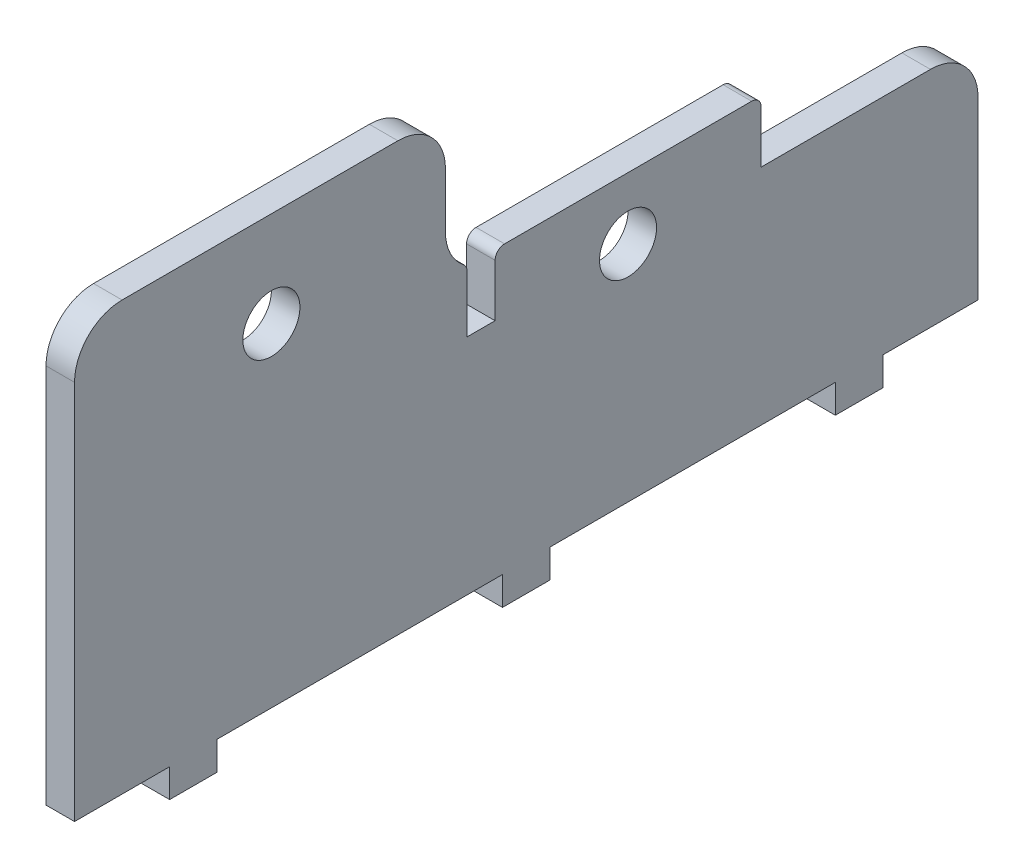
ISO-10303-21;
HEADER;
FILE_DESCRIPTION(('STEP AP214'),'2;1');
FILE_NAME('part.step','',(''),(''),'','','');
FILE_SCHEMA(('AUTOMOTIVE_DESIGN { 1 0 10303 214 1 1 1 1 }'));
ENDSEC;
DATA;
#1=APPLICATION_CONTEXT('core data for automotive mechanical design processes');
#2=APPLICATION_PROTOCOL_DEFINITION('international standard','automotive_design',2000,#1);
#3=PRODUCT_CONTEXT('',#1,'mechanical');
#4=PRODUCT('Part','Part','',(#3));
#5=PRODUCT_RELATED_PRODUCT_CATEGORY('part','',(#4));
#6=PRODUCT_DEFINITION_FORMATION('','',#4);
#7=PRODUCT_DEFINITION_CONTEXT('part definition',#1,'design');
#8=PRODUCT_DEFINITION('design','',#6,#7);
#9=PRODUCT_DEFINITION_SHAPE('','',#8);
#10=(LENGTH_UNIT() NAMED_UNIT(*) SI_UNIT(.MILLI.,.METRE.));
#11=(NAMED_UNIT(*) PLANE_ANGLE_UNIT() SI_UNIT($,.RADIAN.));
#12=(NAMED_UNIT(*) SI_UNIT($,.STERADIAN.) SOLID_ANGLE_UNIT());
#13=UNCERTAINTY_MEASURE_WITH_UNIT(LENGTH_MEASURE(1.E-05),#10,'distance_accuracy_value','');
#14=(GEOMETRIC_REPRESENTATION_CONTEXT(3) GLOBAL_UNCERTAINTY_ASSIGNED_CONTEXT((#13)) GLOBAL_UNIT_ASSIGNED_CONTEXT((#10,
#11,#12)) REPRESENTATION_CONTEXT('',''));
#15=CARTESIAN_POINT('',(0.,0.,0.));
#16=DIRECTION('',(0.,0.,1.));
#17=DIRECTION('',(1.,0.,0.));
#18=AXIS2_PLACEMENT_3D('',#15,#16,#17);
#19=CARTESIAN_POINT('',(3.,0.,-65.));
#20=DIRECTION('',(0.,1.,0.));
#21=DIRECTION('',(0.,0.,1.));
#22=AXIS2_PLACEMENT_3D('',#19,#20,#21);
#23=PLANE('',#22);
#24=DIRECTION('',(0.,0.,-1.));
#25=VECTOR('',#24,1.);
#26=CARTESIAN_POINT('',(0.,0.,-65.));
#27=LINE('',#26,#25);
#28=CARTESIAN_POINT('',(0.,0.,-20.));
#29=VERTEX_POINT('',#28);
#30=CARTESIAN_POINT('',(0.,0.,-50.));
#31=VERTEX_POINT('',#30);
#32=EDGE_CURVE('E541',#29,#31,#27,.T.);
#33=ORIENTED_EDGE('',*,*,#32,.T.);
#34=DIRECTION('',(1.,0.,0.));
#35=VECTOR('',#34,1.);
#36=CARTESIAN_POINT('',(3.,0.,-50.));
#37=LINE('',#36,#35);
#38=CARTESIAN_POINT('',(3.,0.,-50.));
#39=VERTEX_POINT('',#38);
#40=EDGE_CURVE('E282',#31,#39,#37,.T.);
#41=ORIENTED_EDGE('',*,*,#40,.T.);
#42=DIRECTION('',(0.,0.,-1.));
#43=VECTOR('',#42,1.);
#44=CARTESIAN_POINT('',(3.,0.,-65.));
#45=LINE('',#44,#43);
#46=CARTESIAN_POINT('',(3.,0.,-20.));
#47=VERTEX_POINT('',#46);
#48=EDGE_CURVE('E527',#47,#39,#45,.T.);
#49=ORIENTED_EDGE('',*,*,#48,.F.);
#50=DIRECTION('',(-1.,0.,0.));
#51=VECTOR('',#50,1.);
#52=CARTESIAN_POINT('',(3.,0.,-20.));
#53=LINE('',#52,#51);
#54=EDGE_CURVE('E298',#47,#29,#53,.T.);
#55=ORIENTED_EDGE('',*,*,#54,.T.);
#56=EDGE_LOOP('',(#33,#41,#49,#55));
#57=FACE_BOUND('',#56,.T.);
#58=ADVANCED_FACE('F36',(#57),#23,.F.);
#59=CARTESIAN_POINT('',(0.,0.,15.));
#60=VERTEX_POINT('',#59);
#61=CARTESIAN_POINT('',(0.,0.,-15.));
#62=VERTEX_POINT('',#61);
#63=EDGE_CURVE('E407',#60,#62,#27,.T.);
#64=ORIENTED_EDGE('',*,*,#63,.T.);
#65=DIRECTION('',(1.,0.,0.));
#66=VECTOR('',#65,1.);
#67=CARTESIAN_POINT('',(3.,0.,-15.));
#68=LINE('',#67,#66);
#69=CARTESIAN_POINT('',(3.,0.,-15.));
#70=VERTEX_POINT('',#69);
#71=EDGE_CURVE('E311',#62,#70,#68,.T.);
#72=ORIENTED_EDGE('',*,*,#71,.T.);
#73=CARTESIAN_POINT('',(3.,0.,15.));
#74=VERTEX_POINT('',#73);
#75=EDGE_CURVE('E394',#74,#70,#45,.T.);
#76=ORIENTED_EDGE('',*,*,#75,.F.);
#77=DIRECTION('',(-1.,0.,0.));
#78=VECTOR('',#77,1.);
#79=CARTESIAN_POINT('',(3.,0.,15.));
#80=LINE('',#79,#78);
#81=EDGE_CURVE('E359',#74,#60,#80,.T.);
#82=ORIENTED_EDGE('',*,*,#81,.T.);
#83=EDGE_LOOP('',(#64,#72,#76,#82));
#84=FACE_BOUND('',#83,.T.);
#85=ADVANCED_FACE('F585',(#84),#23,.F.);
#86=CARTESIAN_POINT('',(3.,30.,-65.));
#87=DIRECTION('',(0.,-1.,0.));
#88=DIRECTION('',(0.,0.,-1.));
#89=AXIS2_PLACEMENT_3D('',#86,#87,#88);
#90=PLANE('',#89);
#91=DIRECTION('',(0.,0.,1.));
#92=VECTOR('',#91,1.);
#93=CARTESIAN_POINT('',(3.,30.,-65.));
#94=LINE('',#93,#92);
#95=CARTESIAN_POINT('',(3.,30.,-41.2));
#96=VERTEX_POINT('',#95);
#97=CARTESIAN_POINT('',(3.,30.,-15.2213645180627));
#98=VERTEX_POINT('',#97);
#99=EDGE_CURVE('E397',#96,#98,#94,.T.);
#100=ORIENTED_EDGE('',*,*,#99,.F.);
#101=DIRECTION('',(1.,0.,0.));
#102=VECTOR('',#101,1.);
#103=CARTESIAN_POINT('',(3.,30.,-41.2));
#104=LINE('',#103,#102);
#105=CARTESIAN_POINT('',(0.,30.,-41.2));
#106=VERTEX_POINT('',#105);
#107=EDGE_CURVE('E461',#96,#106,#104,.F.);
#108=ORIENTED_EDGE('',*,*,#107,.T.);
#109=DIRECTION('',(0.,0.,1.));
#110=VECTOR('',#109,1.);
#111=CARTESIAN_POINT('',(0.,30.,-65.));
#112=LINE('',#111,#110);
#113=CARTESIAN_POINT('',(0.,30.,-15.2213645180627));
#114=VERTEX_POINT('',#113);
#115=EDGE_CURVE('E389',#106,#114,#112,.T.);
#116=ORIENTED_EDGE('',*,*,#115,.T.);
#117=DIRECTION('',(1.,0.,0.));
#118=VECTOR('',#117,1.);
#119=CARTESIAN_POINT('',(3.,30.,-15.2213645180627));
#120=LINE('',#119,#118);
#121=EDGE_CURVE('E458',#114,#98,#120,.T.);
#122=ORIENTED_EDGE('',*,*,#121,.T.);
#123=EDGE_LOOP('',(#100,#108,#116,#122));
#124=FACE_BOUND('',#123,.T.);
#125=ADVANCED_FACE('F569',(#124),#90,.F.);
#126=CARTESIAN_POINT('',(3.,0.,-55.));
#127=VERTEX_POINT('',#126);
#128=CARTESIAN_POINT('',(3.,0.,-65.));
#129=VERTEX_POINT('',#128);
#130=EDGE_CURVE('E388',#127,#129,#45,.T.);
#131=ORIENTED_EDGE('',*,*,#130,.F.);
#132=DIRECTION('',(-1.,0.,0.));
#133=VECTOR('',#132,1.);
#134=CARTESIAN_POINT('',(3.,0.,-55.));
#135=LINE('',#134,#133);
#136=CARTESIAN_POINT('',(0.,0.,-55.));
#137=VERTEX_POINT('',#136);
#138=EDGE_CURVE('E264',#127,#137,#135,.T.);
#139=ORIENTED_EDGE('',*,*,#138,.T.);
#140=CARTESIAN_POINT('',(0.,0.,-65.));
#141=VERTEX_POINT('',#140);
#142=EDGE_CURVE('E402',#137,#141,#27,.T.);
#143=ORIENTED_EDGE('',*,*,#142,.T.);
#144=DIRECTION('',(-1.,0.,0.));
#145=VECTOR('',#144,1.);
#146=CARTESIAN_POINT('',(3.,0.,-65.));
#147=LINE('',#146,#145);
#148=EDGE_CURVE('E400',#129,#141,#147,.T.);
#149=ORIENTED_EDGE('',*,*,#148,.F.);
#150=EDGE_LOOP('',(#131,#139,#143,#149));
#151=FACE_BOUND('',#150,.T.);
#152=ADVANCED_FACE('F547',(#151),#23,.F.);
#153=CARTESIAN_POINT('',(3.,0.,30.));
#154=DIRECTION('',(0.,0.,-1.));
#155=DIRECTION('',(-1.,0.,0.));
#156=AXIS2_PLACEMENT_3D('',#153,#154,#155);
#157=PLANE('',#156);
#158=DIRECTION('',(0.,-1.,0.));
#159=VECTOR('',#158,1.);
#160=CARTESIAN_POINT('',(3.,0.,30.));
#161=LINE('',#160,#159);
#162=CARTESIAN_POINT('',(3.,40.,30.));
#163=VERTEX_POINT('',#162);
#164=CARTESIAN_POINT('',(3.,0.,30.));
#165=VERTEX_POINT('',#164);
#166=EDGE_CURVE('E386',#163,#165,#161,.T.);
#167=ORIENTED_EDGE('',*,*,#166,.F.);
#168=DIRECTION('',(1.,0.,0.));
#169=VECTOR('',#168,1.);
#170=CARTESIAN_POINT('',(0.,40.,30.));
#171=LINE('',#170,#169);
#172=CARTESIAN_POINT('',(0.,40.,30.));
#173=VERTEX_POINT('',#172);
#174=EDGE_CURVE('E443',#163,#173,#171,.F.);
#175=ORIENTED_EDGE('',*,*,#174,.T.);
#176=DIRECTION('',(0.,-1.,0.));
#177=VECTOR('',#176,1.);
#178=CARTESIAN_POINT('',(0.,0.,30.));
#179=LINE('',#178,#177);
#180=CARTESIAN_POINT('',(0.,0.,30.));
#181=VERTEX_POINT('',#180);
#182=EDGE_CURVE('E380',#173,#181,#179,.T.);
#183=ORIENTED_EDGE('',*,*,#182,.T.);
#184=DIRECTION('',(-1.,0.,0.));
#185=VECTOR('',#184,1.);
#186=CARTESIAN_POINT('',(3.,0.,30.));
#187=LINE('',#186,#185);
#188=EDGE_CURVE('E240',#165,#181,#187,.T.);
#189=ORIENTED_EDGE('',*,*,#188,.F.);
#190=EDGE_LOOP('',(#167,#175,#183,#189));
#191=FACE_BOUND('',#190,.T.);
#192=ADVANCED_FACE('F505',(#191),#157,.F.);
#193=CARTESIAN_POINT('',(0.,0.,20.));
#194=VERTEX_POINT('',#193);
#195=EDGE_CURVE('E403',#181,#194,#27,.T.);
#196=ORIENTED_EDGE('',*,*,#195,.T.);
#197=DIRECTION('',(1.,0.,0.));
#198=VECTOR('',#197,1.);
#199=CARTESIAN_POINT('',(3.,0.,20.));
#200=LINE('',#199,#198);
#201=CARTESIAN_POINT('',(3.,0.,20.));
#202=VERTEX_POINT('',#201);
#203=EDGE_CURVE('E364',#194,#202,#200,.T.);
#204=ORIENTED_EDGE('',*,*,#203,.T.);
#205=EDGE_CURVE('E390',#165,#202,#45,.T.);
#206=ORIENTED_EDGE('',*,*,#205,.F.);
#207=ORIENTED_EDGE('',*,*,#188,.T.);
#208=EDGE_LOOP('',(#196,#204,#206,#207));
#209=FACE_BOUND('',#208,.T.);
#210=ADVANCED_FACE('F509',(#209),#23,.F.);
#211=CARTESIAN_POINT('',(3.,0.,-65.));
#212=DIRECTION('',(0.,0.,1.));
#213=DIRECTION('',(1.,0.,0.));
#214=AXIS2_PLACEMENT_3D('',#211,#212,#213);
#215=PLANE('',#214);
#216=DIRECTION('',(0.,1.,0.));
#217=VECTOR('',#216,1.);
#218=CARTESIAN_POINT('',(0.,0.,-65.));
#219=LINE('',#218,#217);
#220=CARTESIAN_POINT('',(0.,18.5,-65.));
#221=VERTEX_POINT('',#220);
#222=EDGE_CURVE('E406',#141,#221,#219,.T.);
#223=ORIENTED_EDGE('',*,*,#222,.T.);
#224=DIRECTION('',(1.,0.,0.));
#225=VECTOR('',#224,1.);
#226=CARTESIAN_POINT('',(3.,18.5,-65.));
#227=LINE('',#226,#225);
#228=CARTESIAN_POINT('',(3.,18.5,-65.));
#229=VERTEX_POINT('',#228);
#230=EDGE_CURVE('E420',#221,#229,#227,.T.);
#231=ORIENTED_EDGE('',*,*,#230,.T.);
#232=DIRECTION('',(0.,1.,0.));
#233=VECTOR('',#232,1.);
#234=CARTESIAN_POINT('',(3.,0.,-65.));
#235=LINE('',#234,#233);
#236=EDGE_CURVE('E393',#129,#229,#235,.T.);
#237=ORIENTED_EDGE('',*,*,#236,.F.);
#238=ORIENTED_EDGE('',*,*,#148,.T.);
#239=EDGE_LOOP('',(#223,#231,#237,#238));
#240=FACE_BOUND('',#239,.T.);
#241=ADVANCED_FACE('F550',(#240),#215,.F.);
#242=CARTESIAN_POINT('',(3.,0.,0.));
#243=DIRECTION('',(1.,0.,0.));
#244=DIRECTION('',(0.,0.,-1.));
#245=AXIS2_PLACEMENT_3D('',#242,#243,#244);
#246=PLANE('',#245);
#247=DIRECTION('',(0.,-1.,0.));
#248=VECTOR('',#247,1.);
#249=CARTESIAN_POINT('',(3.,30.,-42.2));
#250=LINE('',#249,#248);
#251=CARTESIAN_POINT('',(3.,29.,-42.2));
#252=VERTEX_POINT('',#251);
#253=CARTESIAN_POINT('',(3.,23.5,-42.2));
#254=VERTEX_POINT('',#253);
#255=EDGE_CURVE('E272',#252,#254,#250,.T.);
#256=ORIENTED_EDGE('',*,*,#255,.F.);
#257=CARTESIAN_POINT('',(3.,29.,-41.2));
#258=DIRECTION('',(1.,0.,0.));
#259=DIRECTION('',(0.,0.,-1.));
#260=AXIS2_PLACEMENT_3D('',#257,#258,#259);
#261=CIRCLE('',#260,1.);
#262=EDGE_CURVE('E456',#252,#96,#261,.T.);
#263=ORIENTED_EDGE('',*,*,#262,.T.);
#264=ORIENTED_EDGE('',*,*,#99,.T.);
#265=CARTESIAN_POINT('',(3.,29.,-15.2213645180627));
#266=DIRECTION('',(1.,0.,0.));
#267=DIRECTION('',(0.,0.,-1.));
#268=AXIS2_PLACEMENT_3D('',#265,#266,#267);
#269=CIRCLE('',#268,1.);
#270=CARTESIAN_POINT('',(3.,29.,-14.2213645180627));
#271=VERTEX_POINT('',#270);
#272=EDGE_CURVE('E452',#98,#271,#269,.T.);
#273=ORIENTED_EDGE('',*,*,#272,.T.);
#274=DIRECTION('',(0.,1.,0.));
#275=VECTOR('',#274,1.);
#276=CARTESIAN_POINT('',(3.,32.2061925482817,-14.2213645180627));
#277=LINE('',#276,#275);
#278=CARTESIAN_POINT('',(3.,23.5,-14.2213645180627));
#279=VERTEX_POINT('',#278);
#280=EDGE_CURVE('E255',#279,#271,#277,.T.);
#281=ORIENTED_EDGE('',*,*,#280,.F.);
#282=DIRECTION('',(0.,0.,-1.));
#283=VECTOR('',#282,1.);
#284=CARTESIAN_POINT('',(3.,23.5,-11.2713645180627));
#285=LINE('',#284,#283);
#286=CARTESIAN_POINT('',(3.,23.5,-11.2713645180627));
#287=VERTEX_POINT('',#286);
#288=EDGE_CURVE('E258',#287,#279,#285,.T.);
#289=ORIENTED_EDGE('',*,*,#288,.F.);
#290=DIRECTION('',(0.,-1.,0.));
#291=VECTOR('',#290,1.);
#292=CARTESIAN_POINT('',(3.,32.2061925482817,-11.2713645180627));
#293=LINE('',#292,#291);
#294=CARTESIAN_POINT('',(3.,29.4890407092853,-11.2713645180627));
#295=VERTEX_POINT('',#294);
#296=EDGE_CURVE('E246',#295,#287,#293,.T.);
#297=ORIENTED_EDGE('',*,*,#296,.F.);
#298=CARTESIAN_POINT('',(3.,29.4890407092853,-10.2713645180627));
#299=DIRECTION('',(1.,0.,0.));
#300=DIRECTION('',(0.,0.,-1.));
#301=AXIS2_PLACEMENT_3D('',#298,#299,#300);
#302=CIRCLE('',#301,1.);
#303=CARTESIAN_POINT('',(3.,30.2725030646675,-10.8928037650522));
#304=VERTEX_POINT('',#303);
#305=EDGE_CURVE('E454',#295,#304,#302,.T.);
#306=ORIENTED_EDGE('',*,*,#305,.T.);
#307=CARTESIAN_POINT('',(3.,34.1898148415786,-14.));
#308=DIRECTION('',(1.,0.,0.));
#309=DIRECTION('',(0.,0.,-1.));
#310=AXIS2_PLACEMENT_3D('',#307,#308,#309);
#311=CIRCLE('',#310,5.);
#312=CARTESIAN_POINT('',(3.,34.1898148415786,-9.));
#313=VERTEX_POINT('',#312);
#314=EDGE_CURVE('E447',#304,#313,#311,.F.);
#315=ORIENTED_EDGE('',*,*,#314,.T.);
#316=DIRECTION('',(0.,-1.,0.));
#317=VECTOR('',#316,1.);
#318=CARTESIAN_POINT('',(3.,45.,-9.));
#319=LINE('',#318,#317);
#320=CARTESIAN_POINT('',(3.,40.,-9.));
#321=VERTEX_POINT('',#320);
#322=EDGE_CURVE('E356',#321,#313,#319,.T.);
#323=ORIENTED_EDGE('',*,*,#322,.F.);
#324=CARTESIAN_POINT('',(3.,40.,-4.));
#325=DIRECTION('',(1.,0.,0.));
#326=DIRECTION('',(0.,0.,-1.));
#327=AXIS2_PLACEMENT_3D('',#324,#325,#326);
#328=CIRCLE('',#327,5.);
#329=CARTESIAN_POINT('',(3.,45.,-4.));
#330=VERTEX_POINT('',#329);
#331=EDGE_CURVE('E425',#321,#330,#328,.T.);
#332=ORIENTED_EDGE('',*,*,#331,.T.);
#333=DIRECTION('',(0.,0.,-1.));
#334=VECTOR('',#333,1.);
#335=CARTESIAN_POINT('',(3.,45.,-9.));
#336=LINE('',#335,#334);
#337=CARTESIAN_POINT('',(3.,45.,25.));
#338=VERTEX_POINT('',#337);
#339=EDGE_CURVE('E350',#338,#330,#336,.T.);
#340=ORIENTED_EDGE('',*,*,#339,.F.);
#341=CARTESIAN_POINT('',(3.,40.,25.));
#342=DIRECTION('',(1.,0.,0.));
#343=DIRECTION('',(0.,0.,-1.));
#344=AXIS2_PLACEMENT_3D('',#341,#342,#343);
#345=CIRCLE('',#344,5.);
#346=EDGE_CURVE('E423',#338,#163,#345,.T.);
#347=ORIENTED_EDGE('',*,*,#346,.T.);
#348=ORIENTED_EDGE('',*,*,#166,.T.);
#349=ORIENTED_EDGE('',*,*,#205,.T.);
#350=DIRECTION('',(0.,1.,0.));
#351=VECTOR('',#350,1.);
#352=CARTESIAN_POINT('',(3.,-3.,20.));
#353=LINE('',#352,#351);
#354=CARTESIAN_POINT('',(3.,-3.,20.));
#355=VERTEX_POINT('',#354);
#356=EDGE_CURVE('E378',#355,#202,#353,.T.);
#357=ORIENTED_EDGE('',*,*,#356,.F.);
#358=DIRECTION('',(0.,0.,-1.));
#359=VECTOR('',#358,1.);
#360=CARTESIAN_POINT('',(3.,-3.,20.));
#361=LINE('',#360,#359);
#362=CARTESIAN_POINT('',(3.,-3.,15.));
#363=VERTEX_POINT('',#362);
#364=EDGE_CURVE('E360',#355,#363,#361,.T.);
#365=ORIENTED_EDGE('',*,*,#364,.T.);
#366=DIRECTION('',(0.,1.,0.));
#367=VECTOR('',#366,1.);
#368=CARTESIAN_POINT('',(3.,-3.,15.));
#369=LINE('',#368,#367);
#370=EDGE_CURVE('E373',#363,#74,#369,.T.);
#371=ORIENTED_EDGE('',*,*,#370,.T.);
#372=ORIENTED_EDGE('',*,*,#75,.T.);
#373=DIRECTION('',(0.,1.,0.));
#374=VECTOR('',#373,1.);
#375=CARTESIAN_POINT('',(3.,-3.,-15.));
#376=LINE('',#375,#374);
#377=CARTESIAN_POINT('',(3.,-3.,-15.));
#378=VERTEX_POINT('',#377);
#379=EDGE_CURVE('E324',#378,#70,#376,.T.);
#380=ORIENTED_EDGE('',*,*,#379,.F.);
#381=DIRECTION('',(0.,0.,-1.));
#382=VECTOR('',#381,1.);
#383=CARTESIAN_POINT('',(3.,-3.,-15.));
#384=LINE('',#383,#382);
#385=CARTESIAN_POINT('',(3.,-3.,-20.));
#386=VERTEX_POINT('',#385);
#387=EDGE_CURVE('E307',#378,#386,#384,.T.);
#388=ORIENTED_EDGE('',*,*,#387,.T.);
#389=DIRECTION('',(0.,1.,0.));
#390=VECTOR('',#389,1.);
#391=CARTESIAN_POINT('',(3.,-3.,-20.));
#392=LINE('',#391,#390);
#393=EDGE_CURVE('E320',#386,#47,#392,.T.);
#394=ORIENTED_EDGE('',*,*,#393,.T.);
#395=ORIENTED_EDGE('',*,*,#48,.T.);
#396=DIRECTION('',(0.,1.,0.));
#397=VECTOR('',#396,1.);
#398=CARTESIAN_POINT('',(3.,-3.,-50.));
#399=LINE('',#398,#397);
#400=CARTESIAN_POINT('',(3.,-3.,-50.));
#401=VERTEX_POINT('',#400);
#402=EDGE_CURVE('E295',#401,#39,#399,.T.);
#403=ORIENTED_EDGE('',*,*,#402,.F.);
#404=DIRECTION('',(0.,0.,-1.));
#405=VECTOR('',#404,1.);
#406=CARTESIAN_POINT('',(3.,-3.,-50.));
#407=LINE('',#406,#405);
#408=CARTESIAN_POINT('',(3.,-3.,-55.));
#409=VERTEX_POINT('',#408);
#410=EDGE_CURVE('E278',#401,#409,#407,.T.);
#411=ORIENTED_EDGE('',*,*,#410,.T.);
#412=DIRECTION('',(0.,1.,0.));
#413=VECTOR('',#412,1.);
#414=CARTESIAN_POINT('',(3.,-3.,-55.));
#415=LINE('',#414,#413);
#416=EDGE_CURVE('E291',#409,#127,#415,.T.);
#417=ORIENTED_EDGE('',*,*,#416,.T.);
#418=ORIENTED_EDGE('',*,*,#130,.T.);
#419=ORIENTED_EDGE('',*,*,#236,.T.);
#420=CARTESIAN_POINT('',(3.,18.5,-60.));
#421=DIRECTION('',(1.,0.,0.));
#422=DIRECTION('',(0.,0.,-1.));
#423=AXIS2_PLACEMENT_3D('',#420,#421,#422);
#424=CIRCLE('',#423,5.);
#425=CARTESIAN_POINT('',(3.,23.5,-60.));
#426=VERTEX_POINT('',#425);
#427=EDGE_CURVE('E427',#229,#426,#424,.T.);
#428=ORIENTED_EDGE('',*,*,#427,.T.);
#429=DIRECTION('',(0.,0.,-1.));
#430=VECTOR('',#429,1.);
#431=CARTESIAN_POINT('',(3.,23.5,-42.2));
#432=LINE('',#431,#430);
#433=EDGE_CURVE('E269',#254,#426,#432,.T.);
#434=ORIENTED_EDGE('',*,*,#433,.F.);
#435=EDGE_LOOP('',(#256,#263,#264,#273,#281,#289,#297,#306,#315,#323,#332,#340,#347,#348,#349,
#357,#365,#371,#372,#380,#388,#394,#395,#403,#411,#417,#418,#419,#428,#434));
#436=FACE_BOUND('',#435,.T.);
#437=CARTESIAN_POINT('',(3.,35.,9.29999999999999));
#438=DIRECTION('',(1.,0.,0.));
#439=DIRECTION('',(0.,0.,-1.));
#440=AXIS2_PLACEMENT_3D('',#437,#438,#439);
#441=CIRCLE('',#440,3.);
#442=CARTESIAN_POINT('',(3.,35.,6.29999999999999));
#443=VERTEX_POINT('',#442);
#444=EDGE_CURVE('E340',#443,#443,#441,.T.);
#445=ORIENTED_EDGE('',*,*,#444,.F.);
#446=EDGE_LOOP('',(#445));
#447=FACE_BOUND('',#446,.T.);
#448=CARTESIAN_POINT('',(3.,23.5,-28.2));
#449=DIRECTION('',(1.,0.,0.));
#450=DIRECTION('',(0.,0.,-1.));
#451=AXIS2_PLACEMENT_3D('',#448,#449,#450);
#452=CIRCLE('',#451,3.);
#453=CARTESIAN_POINT('',(3.,23.5,-31.2));
#454=VERTEX_POINT('',#453);
#455=EDGE_CURVE('E327',#454,#454,#452,.T.);
#456=ORIENTED_EDGE('',*,*,#455,.F.);
#457=EDGE_LOOP('',(#456));
#458=FACE_BOUND('',#457,.T.);
#459=ADVANCED_FACE('F474',(#436,#447,#458),#246,.T.);
#460=CARTESIAN_POINT('',(0.,0.,0.));
#461=DIRECTION('',(1.,0.,0.));
#462=DIRECTION('',(0.,0.,-1.));
#463=AXIS2_PLACEMENT_3D('',#460,#461,#462);
#464=PLANE('',#463);
#465=ORIENTED_EDGE('',*,*,#115,.F.);
#466=CARTESIAN_POINT('',(0.,29.,-41.2));
#467=DIRECTION('',(1.,0.,0.));
#468=DIRECTION('',(0.,0.,-1.));
#469=AXIS2_PLACEMENT_3D('',#466,#467,#468);
#470=CIRCLE('',#469,1.);
#471=CARTESIAN_POINT('',(0.,29.,-42.2));
#472=VERTEX_POINT('',#471);
#473=EDGE_CURVE('E466',#106,#472,#470,.F.);
#474=ORIENTED_EDGE('',*,*,#473,.T.);
#475=DIRECTION('',(0.,-1.,0.));
#476=VECTOR('',#475,1.);
#477=CARTESIAN_POINT('',(0.,30.,-42.2));
#478=LINE('',#477,#476);
#479=CARTESIAN_POINT('',(0.,23.5,-42.2));
#480=VERTEX_POINT('',#479);
#481=EDGE_CURVE('E266',#472,#480,#478,.T.);
#482=ORIENTED_EDGE('',*,*,#481,.T.);
#483=DIRECTION('',(0.,0.,-1.));
#484=VECTOR('',#483,1.);
#485=CARTESIAN_POINT('',(0.,23.5,-42.2));
#486=LINE('',#485,#484);
#487=CARTESIAN_POINT('',(0.,23.5,-60.));
#488=VERTEX_POINT('',#487);
#489=EDGE_CURVE('E268',#480,#488,#486,.T.);
#490=ORIENTED_EDGE('',*,*,#489,.T.);
#491=CARTESIAN_POINT('',(0.,18.5,-60.));
#492=DIRECTION('',(1.,0.,0.));
#493=DIRECTION('',(0.,0.,-1.));
#494=AXIS2_PLACEMENT_3D('',#491,#492,#493);
#495=CIRCLE('',#494,5.);
#496=EDGE_CURVE('E435',#488,#221,#495,.F.);
#497=ORIENTED_EDGE('',*,*,#496,.T.);
#498=ORIENTED_EDGE('',*,*,#222,.F.);
#499=ORIENTED_EDGE('',*,*,#142,.F.);
#500=DIRECTION('',(0.,1.,0.));
#501=VECTOR('',#500,1.);
#502=CARTESIAN_POINT('',(0.,-3.,-55.));
#503=LINE('',#502,#501);
#504=CARTESIAN_POINT('',(0.,-3.,-55.));
#505=VERTEX_POINT('',#504);
#506=EDGE_CURVE('E302',#505,#137,#503,.T.);
#507=ORIENTED_EDGE('',*,*,#506,.F.);
#508=DIRECTION('',(0.,0.,1.));
#509=VECTOR('',#508,1.);
#510=CARTESIAN_POINT('',(0.,-3.,-50.));
#511=LINE('',#510,#509);
#512=CARTESIAN_POINT('',(0.,-3.,-50.));
#513=VERTEX_POINT('',#512);
#514=EDGE_CURVE('E285',#505,#513,#511,.T.);
#515=ORIENTED_EDGE('',*,*,#514,.T.);
#516=DIRECTION('',(0.,1.,0.));
#517=VECTOR('',#516,1.);
#518=CARTESIAN_POINT('',(0.,-3.,-50.));
#519=LINE('',#518,#517);
#520=EDGE_CURVE('E299',#513,#31,#519,.T.);
#521=ORIENTED_EDGE('',*,*,#520,.T.);
#522=ORIENTED_EDGE('',*,*,#32,.F.);
#523=DIRECTION('',(0.,1.,0.));
#524=VECTOR('',#523,1.);
#525=CARTESIAN_POINT('',(0.,-3.,-20.));
#526=LINE('',#525,#524);
#527=CARTESIAN_POINT('',(0.,-3.,-20.));
#528=VERTEX_POINT('',#527);
#529=EDGE_CURVE('E331',#528,#29,#526,.T.);
#530=ORIENTED_EDGE('',*,*,#529,.F.);
#531=DIRECTION('',(0.,0.,1.));
#532=VECTOR('',#531,1.);
#533=CARTESIAN_POINT('',(0.,-3.,-15.));
#534=LINE('',#533,#532);
#535=CARTESIAN_POINT('',(0.,-3.,-15.));
#536=VERTEX_POINT('',#535);
#537=EDGE_CURVE('E314',#528,#536,#534,.T.);
#538=ORIENTED_EDGE('',*,*,#537,.T.);
#539=DIRECTION('',(0.,1.,0.));
#540=VECTOR('',#539,1.);
#541=CARTESIAN_POINT('',(0.,-3.,-15.));
#542=LINE('',#541,#540);
#543=EDGE_CURVE('E328',#536,#62,#542,.T.);
#544=ORIENTED_EDGE('',*,*,#543,.T.);
#545=ORIENTED_EDGE('',*,*,#63,.F.);
#546=DIRECTION('',(0.,1.,0.));
#547=VECTOR('',#546,1.);
#548=CARTESIAN_POINT('',(0.,-3.,15.));
#549=LINE('',#548,#547);
#550=CARTESIAN_POINT('',(0.,-3.,15.));
#551=VERTEX_POINT('',#550);
#552=EDGE_CURVE('E383',#551,#60,#549,.T.);
#553=ORIENTED_EDGE('',*,*,#552,.F.);
#554=DIRECTION('',(0.,0.,1.));
#555=VECTOR('',#554,1.);
#556=CARTESIAN_POINT('',(0.,-3.,20.));
#557=LINE('',#556,#555);
#558=CARTESIAN_POINT('',(0.,-3.,20.));
#559=VERTEX_POINT('',#558);
#560=EDGE_CURVE('E367',#551,#559,#557,.T.);
#561=ORIENTED_EDGE('',*,*,#560,.T.);
#562=DIRECTION('',(0.,1.,0.));
#563=VECTOR('',#562,1.);
#564=CARTESIAN_POINT('',(0.,-3.,20.));
#565=LINE('',#564,#563);
#566=EDGE_CURVE('E381',#559,#194,#565,.T.);
#567=ORIENTED_EDGE('',*,*,#566,.T.);
#568=ORIENTED_EDGE('',*,*,#195,.F.);
#569=ORIENTED_EDGE('',*,*,#182,.F.);
#570=CARTESIAN_POINT('',(0.,40.,25.));
#571=DIRECTION('',(1.,0.,0.));
#572=DIRECTION('',(0.,0.,-1.));
#573=AXIS2_PLACEMENT_3D('',#570,#571,#572);
#574=CIRCLE('',#573,5.);
#575=CARTESIAN_POINT('',(0.,45.,25.));
#576=VERTEX_POINT('',#575);
#577=EDGE_CURVE('E431',#173,#576,#574,.F.);
#578=ORIENTED_EDGE('',*,*,#577,.T.);
#579=DIRECTION('',(0.,0.,1.));
#580=VECTOR('',#579,1.);
#581=CARTESIAN_POINT('',(0.,45.,-9.));
#582=LINE('',#581,#580);
#583=CARTESIAN_POINT('',(0.,45.,-4.));
#584=VERTEX_POINT('',#583);
#585=EDGE_CURVE('E339',#584,#576,#582,.T.);
#586=ORIENTED_EDGE('',*,*,#585,.F.);
#587=CARTESIAN_POINT('',(0.,40.,-4.));
#588=DIRECTION('',(1.,0.,0.));
#589=DIRECTION('',(0.,0.,-1.));
#590=AXIS2_PLACEMENT_3D('',#587,#588,#589);
#591=CIRCLE('',#590,5.);
#592=CARTESIAN_POINT('',(0.,40.,-9.));
#593=VERTEX_POINT('',#592);
#594=EDGE_CURVE('E433',#584,#593,#591,.F.);
#595=ORIENTED_EDGE('',*,*,#594,.T.);
#596=DIRECTION('',(0.,-1.,0.));
#597=VECTOR('',#596,1.);
#598=CARTESIAN_POINT('',(0.,45.,-9.));
#599=LINE('',#598,#597);
#600=CARTESIAN_POINT('',(0.,34.1898148415786,-9.00000000000001));
#601=VERTEX_POINT('',#600);
#602=EDGE_CURVE('E353',#593,#601,#599,.T.);
#603=ORIENTED_EDGE('',*,*,#602,.T.);
#604=CARTESIAN_POINT('',(0.,34.1898148415786,-14.));
#605=DIRECTION('',(1.,0.,0.));
#606=DIRECTION('',(0.,0.,-1.));
#607=AXIS2_PLACEMENT_3D('',#604,#605,#606);
#608=CIRCLE('',#607,5.);
#609=CARTESIAN_POINT('',(0.,30.2725030646675,-10.8928037650522));
#610=VERTEX_POINT('',#609);
#611=EDGE_CURVE('E445',#601,#610,#608,.T.);
#612=ORIENTED_EDGE('',*,*,#611,.T.);
#613=CARTESIAN_POINT('',(0.,29.4890407092853,-10.2713645180627));
#614=DIRECTION('',(1.,0.,0.));
#615=DIRECTION('',(0.,0.,-1.));
#616=AXIS2_PLACEMENT_3D('',#613,#614,#615);
#617=CIRCLE('',#616,1.);
#618=CARTESIAN_POINT('',(0.,29.4890407092853,-11.2713645180627));
#619=VERTEX_POINT('',#618);
#620=EDGE_CURVE('E57',#610,#619,#617,.F.);
#621=ORIENTED_EDGE('',*,*,#620,.T.);
#622=DIRECTION('',(0.,-1.,0.));
#623=VECTOR('',#622,1.);
#624=CARTESIAN_POINT('',(0.,0.,-11.2713645180627));
#625=LINE('',#624,#623);
#626=CARTESIAN_POINT('',(0.,23.5,-11.2713645180627));
#627=VERTEX_POINT('',#626);
#628=EDGE_CURVE('E230',#619,#627,#625,.T.);
#629=ORIENTED_EDGE('',*,*,#628,.T.);
#630=DIRECTION('',(0.,0.,-1.));
#631=VECTOR('',#630,1.);
#632=CARTESIAN_POINT('',(0.,23.5,-11.2713645180627));
#633=LINE('',#632,#631);
#634=CARTESIAN_POINT('',(0.,23.5,-14.2213645180627));
#635=VERTEX_POINT('',#634);
#636=EDGE_CURVE('E236',#627,#635,#633,.T.);
#637=ORIENTED_EDGE('',*,*,#636,.T.);
#638=DIRECTION('',(0.,1.,0.));
#639=VECTOR('',#638,1.);
#640=CARTESIAN_POINT('',(0.,32.2061925482817,-14.2213645180627));
#641=LINE('',#640,#639);
#642=CARTESIAN_POINT('',(0.,29.,-14.2213645180627));
#643=VERTEX_POINT('',#642);
#644=EDGE_CURVE('E251',#635,#643,#641,.T.);
#645=ORIENTED_EDGE('',*,*,#644,.T.);
#646=CARTESIAN_POINT('',(0.,29.,-15.2213645180627));
#647=DIRECTION('',(1.,0.,0.));
#648=DIRECTION('',(0.,0.,-1.));
#649=AXIS2_PLACEMENT_3D('',#646,#647,#648);
#650=CIRCLE('',#649,1.);
#651=EDGE_CURVE('E463',#643,#114,#650,.F.);
#652=ORIENTED_EDGE('',*,*,#651,.T.);
#653=EDGE_LOOP('',(#465,#474,#482,#490,#497,#498,#499,#507,#515,#521,#522,#530,#538,#544,#545,
#553,#561,#567,#568,#569,#578,#586,#595,#603,#612,#621,#629,#637,#645,#652));
#654=FACE_BOUND('',#653,.T.);
#655=CARTESIAN_POINT('',(0.,35.,9.29999999999999));
#656=DIRECTION('',(1.,0.,0.));
#657=DIRECTION('',(0.,0.,-1.));
#658=AXIS2_PLACEMENT_3D('',#655,#656,#657);
#659=CIRCLE('',#658,3.);
#660=CARTESIAN_POINT('',(0.,35.,6.29999999999999));
#661=VERTEX_POINT('',#660);
#662=EDGE_CURVE('E336',#661,#661,#659,.T.);
#663=ORIENTED_EDGE('',*,*,#662,.T.);
#664=EDGE_LOOP('',(#663));
#665=FACE_BOUND('',#664,.T.);
#666=CARTESIAN_POINT('',(0.,23.5,-28.2));
#667=DIRECTION('',(1.,0.,0.));
#668=DIRECTION('',(0.,0.,-1.));
#669=AXIS2_PLACEMENT_3D('',#666,#667,#668);
#670=CIRCLE('',#669,3.);
#671=CARTESIAN_POINT('',(0.,23.5,-31.2));
#672=VERTEX_POINT('',#671);
#673=EDGE_CURVE('E343',#672,#672,#670,.T.);
#674=ORIENTED_EDGE('',*,*,#673,.T.);
#675=EDGE_LOOP('',(#674));
#676=FACE_BOUND('',#675,.T.);
#677=ADVANCED_FACE('F233',(#654,#665,#676),#464,.F.);
#678=CARTESIAN_POINT('',(3.,-3.,20.));
#679=DIRECTION('',(0.,0.,1.));
#680=DIRECTION('',(1.,0.,0.));
#681=AXIS2_PLACEMENT_3D('',#678,#679,#680);
#682=PLANE('',#681);
#683=ORIENTED_EDGE('',*,*,#203,.F.);
#684=ORIENTED_EDGE('',*,*,#566,.F.);
#685=DIRECTION('',(1.,0.,0.));
#686=VECTOR('',#685,1.);
#687=CARTESIAN_POINT('',(3.,-3.,20.));
#688=LINE('',#687,#686);
#689=EDGE_CURVE('E370',#559,#355,#688,.T.);
#690=ORIENTED_EDGE('',*,*,#689,.T.);
#691=ORIENTED_EDGE('',*,*,#356,.T.);
#692=EDGE_LOOP('',(#683,#684,#690,#691));
#693=FACE_BOUND('',#692,.T.);
#694=ADVANCED_FACE('F518',(#693),#682,.T.);
#695=CARTESIAN_POINT('',(3.,-3.,15.));
#696=DIRECTION('',(0.,0.,-1.));
#697=DIRECTION('',(-1.,0.,0.));
#698=AXIS2_PLACEMENT_3D('',#695,#696,#697);
#699=PLANE('',#698);
#700=ORIENTED_EDGE('',*,*,#81,.F.);
#701=ORIENTED_EDGE('',*,*,#370,.F.);
#702=DIRECTION('',(-1.,0.,0.));
#703=VECTOR('',#702,1.);
#704=CARTESIAN_POINT('',(3.,-3.,15.));
#705=LINE('',#704,#703);
#706=EDGE_CURVE('E363',#363,#551,#705,.T.);
#707=ORIENTED_EDGE('',*,*,#706,.T.);
#708=ORIENTED_EDGE('',*,*,#552,.T.);
#709=EDGE_LOOP('',(#700,#701,#707,#708));
#710=FACE_BOUND('',#709,.T.);
#711=ADVANCED_FACE('F522',(#710),#699,.T.);
#712=CARTESIAN_POINT('',(0.,-3.,0.));
#713=DIRECTION('',(0.,1.,0.));
#714=DIRECTION('',(0.,0.,1.));
#715=AXIS2_PLACEMENT_3D('',#712,#713,#714);
#716=PLANE('',#715);
#717=ORIENTED_EDGE('',*,*,#364,.F.);
#718=ORIENTED_EDGE('',*,*,#689,.F.);
#719=ORIENTED_EDGE('',*,*,#560,.F.);
#720=ORIENTED_EDGE('',*,*,#706,.F.);
#721=EDGE_LOOP('',(#717,#718,#719,#720));
#722=FACE_BOUND('',#721,.T.);
#723=ADVANCED_FACE('F516',(#722),#716,.F.);
#724=CARTESIAN_POINT('',(0.,45.,-9.));
#725=DIRECTION('',(0.,0.,1.));
#726=DIRECTION('',(1.,0.,0.));
#727=AXIS2_PLACEMENT_3D('',#724,#725,#726);
#728=PLANE('',#727);
#729=ORIENTED_EDGE('',*,*,#322,.T.);
#730=DIRECTION('',(-1.,0.,0.));
#731=VECTOR('',#730,1.);
#732=CARTESIAN_POINT('',(0.,34.1898148415786,-9.00000000000001));
#733=LINE('',#732,#731);
#734=EDGE_CURVE('E417',#313,#601,#733,.T.);
#735=ORIENTED_EDGE('',*,*,#734,.T.);
#736=ORIENTED_EDGE('',*,*,#602,.F.);
#737=DIRECTION('',(-1.,0.,0.));
#738=VECTOR('',#737,1.);
#739=CARTESIAN_POINT('',(3.,40.,-9.));
#740=LINE('',#739,#738);
#741=EDGE_CURVE('E239',#593,#321,#740,.F.);
#742=ORIENTED_EDGE('',*,*,#741,.T.);
#743=EDGE_LOOP('',(#729,#735,#736,#742));
#744=FACE_BOUND('',#743,.T.);
#745=ADVANCED_FACE('F487',(#744),#728,.F.);
#746=CARTESIAN_POINT('',(0.,45.,0.));
#747=DIRECTION('',(0.,1.,0.));
#748=DIRECTION('',(0.,0.,1.));
#749=AXIS2_PLACEMENT_3D('',#746,#747,#748);
#750=PLANE('',#749);
#751=ORIENTED_EDGE('',*,*,#339,.T.);
#752=DIRECTION('',(-1.,0.,0.));
#753=VECTOR('',#752,1.);
#754=CARTESIAN_POINT('',(0.,45.,-4.));
#755=LINE('',#754,#753);
#756=EDGE_CURVE('E440',#330,#584,#755,.T.);
#757=ORIENTED_EDGE('',*,*,#756,.T.);
#758=ORIENTED_EDGE('',*,*,#585,.T.);
#759=DIRECTION('',(1.,0.,0.));
#760=VECTOR('',#759,1.);
#761=CARTESIAN_POINT('',(3.,45.,25.));
#762=LINE('',#761,#760);
#763=EDGE_CURVE('E437',#576,#338,#762,.T.);
#764=ORIENTED_EDGE('',*,*,#763,.T.);
#765=EDGE_LOOP('',(#751,#757,#758,#764));
#766=FACE_BOUND('',#765,.T.);
#767=ADVANCED_FACE('F495',(#766),#750,.T.);
#768=CARTESIAN_POINT('',(0.,23.5,-28.2));
#769=DIRECTION('',(1.,0.,0.));
#770=DIRECTION('',(0.,0.,-1.));
#771=AXIS2_PLACEMENT_3D('',#768,#769,#770);
#772=CYLINDRICAL_SURFACE('',#771,3.);
#773=ORIENTED_EDGE('',*,*,#673,.F.);
#774=EDGE_LOOP('',(#773));
#775=FACE_BOUND('',#774,.T.);
#776=ORIENTED_EDGE('',*,*,#455,.T.);
#777=EDGE_LOOP('',(#776));
#778=FACE_BOUND('',#777,.T.);
#779=ADVANCED_FACE('F619',(#775,#778),#772,.F.);
#780=CARTESIAN_POINT('',(0.,35.,9.29999999999999));
#781=DIRECTION('',(1.,0.,0.));
#782=DIRECTION('',(0.,0.,-1.));
#783=AXIS2_PLACEMENT_3D('',#780,#781,#782);
#784=CYLINDRICAL_SURFACE('',#783,3.);
#785=ORIENTED_EDGE('',*,*,#662,.F.);
#786=EDGE_LOOP('',(#785));
#787=FACE_BOUND('',#786,.T.);
#788=ORIENTED_EDGE('',*,*,#444,.T.);
#789=EDGE_LOOP('',(#788));
#790=FACE_BOUND('',#789,.T.);
#791=ADVANCED_FACE('F622',(#787,#790),#784,.F.);
#792=CARTESIAN_POINT('',(3.,-3.,-15.));
#793=DIRECTION('',(0.,0.,1.));
#794=DIRECTION('',(1.,0.,0.));
#795=AXIS2_PLACEMENT_3D('',#792,#793,#794);
#796=PLANE('',#795);
#797=ORIENTED_EDGE('',*,*,#71,.F.);
#798=ORIENTED_EDGE('',*,*,#543,.F.);
#799=DIRECTION('',(1.,0.,0.));
#800=VECTOR('',#799,1.);
#801=CARTESIAN_POINT('',(3.,-3.,-15.));
#802=LINE('',#801,#800);
#803=EDGE_CURVE('E317',#536,#378,#802,.T.);
#804=ORIENTED_EDGE('',*,*,#803,.T.);
#805=ORIENTED_EDGE('',*,*,#379,.T.);
#806=EDGE_LOOP('',(#797,#798,#804,#805));
#807=FACE_BOUND('',#806,.T.);
#808=ADVANCED_FACE('F530',(#807),#796,.T.);
#809=CARTESIAN_POINT('',(3.,-3.,-20.));
#810=DIRECTION('',(0.,0.,-1.));
#811=DIRECTION('',(-1.,0.,0.));
#812=AXIS2_PLACEMENT_3D('',#809,#810,#811);
#813=PLANE('',#812);
#814=ORIENTED_EDGE('',*,*,#54,.F.);
#815=ORIENTED_EDGE('',*,*,#393,.F.);
#816=DIRECTION('',(-1.,0.,0.));
#817=VECTOR('',#816,1.);
#818=CARTESIAN_POINT('',(3.,-3.,-20.));
#819=LINE('',#818,#817);
#820=EDGE_CURVE('E310',#386,#528,#819,.T.);
#821=ORIENTED_EDGE('',*,*,#820,.T.);
#822=ORIENTED_EDGE('',*,*,#529,.T.);
#823=EDGE_LOOP('',(#814,#815,#821,#822));
#824=FACE_BOUND('',#823,.T.);
#825=ADVANCED_FACE('F539',(#824),#813,.T.);
#826=CARTESIAN_POINT('',(0.,-3.,-35.));
#827=DIRECTION('',(0.,1.,0.));
#828=DIRECTION('',(0.,0.,1.));
#829=AXIS2_PLACEMENT_3D('',#826,#827,#828);
#830=PLANE('',#829);
#831=ORIENTED_EDGE('',*,*,#387,.F.);
#832=ORIENTED_EDGE('',*,*,#803,.F.);
#833=ORIENTED_EDGE('',*,*,#537,.F.);
#834=ORIENTED_EDGE('',*,*,#820,.F.);
#835=EDGE_LOOP('',(#831,#832,#833,#834));
#836=FACE_BOUND('',#835,.T.);
#837=ADVANCED_FACE('F534',(#836),#830,.F.);
#838=CARTESIAN_POINT('',(3.,-3.,-50.));
#839=DIRECTION('',(0.,0.,1.));
#840=DIRECTION('',(1.,0.,0.));
#841=AXIS2_PLACEMENT_3D('',#838,#839,#840);
#842=PLANE('',#841);
#843=ORIENTED_EDGE('',*,*,#40,.F.);
#844=ORIENTED_EDGE('',*,*,#520,.F.);
#845=DIRECTION('',(1.,0.,0.));
#846=VECTOR('',#845,1.);
#847=CARTESIAN_POINT('',(3.,-3.,-50.));
#848=LINE('',#847,#846);
#849=EDGE_CURVE('E288',#513,#401,#848,.T.);
#850=ORIENTED_EDGE('',*,*,#849,.T.);
#851=ORIENTED_EDGE('',*,*,#402,.T.);
#852=EDGE_LOOP('',(#843,#844,#850,#851));
#853=FACE_BOUND('',#852,.T.);
#854=ADVANCED_FACE('F633',(#853),#842,.T.);
#855=CARTESIAN_POINT('',(3.,-3.,-55.));
#856=DIRECTION('',(0.,0.,-1.));
#857=DIRECTION('',(-1.,0.,0.));
#858=AXIS2_PLACEMENT_3D('',#855,#856,#857);
#859=PLANE('',#858);
#860=ORIENTED_EDGE('',*,*,#138,.F.);
#861=ORIENTED_EDGE('',*,*,#416,.F.);
#862=DIRECTION('',(-1.,0.,0.));
#863=VECTOR('',#862,1.);
#864=CARTESIAN_POINT('',(3.,-3.,-55.));
#865=LINE('',#864,#863);
#866=EDGE_CURVE('E281',#409,#505,#865,.T.);
#867=ORIENTED_EDGE('',*,*,#866,.T.);
#868=ORIENTED_EDGE('',*,*,#506,.T.);
#869=EDGE_LOOP('',(#860,#861,#867,#868));
#870=FACE_BOUND('',#869,.T.);
#871=ADVANCED_FACE('F634',(#870),#859,.T.);
#872=CARTESIAN_POINT('',(0.,-3.,-70.));
#873=DIRECTION('',(0.,1.,0.));
#874=DIRECTION('',(0.,0.,1.));
#875=AXIS2_PLACEMENT_3D('',#872,#873,#874);
#876=PLANE('',#875);
#877=ORIENTED_EDGE('',*,*,#410,.F.);
#878=ORIENTED_EDGE('',*,*,#849,.F.);
#879=ORIENTED_EDGE('',*,*,#514,.F.);
#880=ORIENTED_EDGE('',*,*,#866,.F.);
#881=EDGE_LOOP('',(#877,#878,#879,#880));
#882=FACE_BOUND('',#881,.T.);
#883=ADVANCED_FACE('F637',(#882),#876,.F.);
#884=CARTESIAN_POINT('',(0.,30.,-42.2));
#885=DIRECTION('',(0.,0.,1.));
#886=DIRECTION('',(1.,0.,0.));
#887=AXIS2_PLACEMENT_3D('',#884,#885,#886);
#888=PLANE('',#887);
#889=ORIENTED_EDGE('',*,*,#481,.F.);
#890=DIRECTION('',(1.,0.,0.));
#891=VECTOR('',#890,1.);
#892=CARTESIAN_POINT('',(0.,29.,-42.2));
#893=LINE('',#892,#891);
#894=EDGE_CURVE('E449',#472,#252,#893,.T.);
#895=ORIENTED_EDGE('',*,*,#894,.T.);
#896=ORIENTED_EDGE('',*,*,#255,.T.);
#897=DIRECTION('',(1.,0.,0.));
#898=VECTOR('',#897,1.);
#899=CARTESIAN_POINT('',(0.,23.5,-42.2));
#900=LINE('',#899,#898);
#901=EDGE_CURVE('E262',#480,#254,#900,.T.);
#902=ORIENTED_EDGE('',*,*,#901,.F.);
#903=EDGE_LOOP('',(#889,#895,#896,#902));
#904=FACE_BOUND('',#903,.T.);
#905=ADVANCED_FACE('F563',(#904),#888,.F.);
#906=CARTESIAN_POINT('',(0.,23.5,-42.2));
#907=DIRECTION('',(0.,-1.,0.));
#908=DIRECTION('',(0.,0.,-1.));
#909=AXIS2_PLACEMENT_3D('',#906,#907,#908);
#910=PLANE('',#909);
#911=ORIENTED_EDGE('',*,*,#433,.T.);
#912=DIRECTION('',(1.,0.,0.));
#913=VECTOR('',#912,1.);
#914=CARTESIAN_POINT('',(0.,23.5,-60.));
#915=LINE('',#914,#913);
#916=EDGE_CURVE('E429',#426,#488,#915,.F.);
#917=ORIENTED_EDGE('',*,*,#916,.T.);
#918=ORIENTED_EDGE('',*,*,#489,.F.);
#919=ORIENTED_EDGE('',*,*,#901,.T.);
#920=EDGE_LOOP('',(#911,#917,#918,#919));
#921=FACE_BOUND('',#920,.T.);
#922=ADVANCED_FACE('F558',(#921),#910,.F.);
#923=CARTESIAN_POINT('',(0.,32.2061925482817,-11.2713645180627));
#924=DIRECTION('',(0.,0.,1.));
#925=DIRECTION('',(0.,-1.,0.));
#926=AXIS2_PLACEMENT_3D('',#923,#924,#925);
#927=PLANE('',#926);
#928=ORIENTED_EDGE('',*,*,#628,.F.);
#929=DIRECTION('',(-1.,0.,0.));
#930=VECTOR('',#929,1.);
#931=CARTESIAN_POINT('',(0.,29.4890407092853,-11.2713645180627));
#932=LINE('',#931,#930);
#933=EDGE_CURVE('E44',#619,#295,#932,.F.);
#934=ORIENTED_EDGE('',*,*,#933,.T.);
#935=ORIENTED_EDGE('',*,*,#296,.T.);
#936=DIRECTION('',(1.,0.,0.));
#937=VECTOR('',#936,1.);
#938=CARTESIAN_POINT('',(0.,23.5,-11.2713645180627));
#939=LINE('',#938,#937);
#940=EDGE_CURVE('E243',#627,#287,#939,.T.);
#941=ORIENTED_EDGE('',*,*,#940,.F.);
#942=EDGE_LOOP('',(#928,#934,#935,#941));
#943=FACE_BOUND('',#942,.T.);
#944=ADVANCED_FACE('F244',(#943),#927,.F.);
#945=CARTESIAN_POINT('',(0.,32.2061925482817,-14.2213645180627));
#946=DIRECTION('',(0.,0.,-1.));
#947=DIRECTION('',(0.,1.,0.));
#948=AXIS2_PLACEMENT_3D('',#945,#946,#947);
#949=PLANE('',#948);
#950=ORIENTED_EDGE('',*,*,#280,.T.);
#951=DIRECTION('',(1.,0.,0.));
#952=VECTOR('',#951,1.);
#953=CARTESIAN_POINT('',(0.,29.,-14.2213645180627));
#954=LINE('',#953,#952);
#955=EDGE_CURVE('E11',#271,#643,#954,.F.);
#956=ORIENTED_EDGE('',*,*,#955,.T.);
#957=ORIENTED_EDGE('',*,*,#644,.F.);
#958=DIRECTION('',(1.,0.,0.));
#959=VECTOR('',#958,1.);
#960=CARTESIAN_POINT('',(0.,23.5,-14.2213645180627));
#961=LINE('',#960,#959);
#962=EDGE_CURVE('E250',#635,#279,#961,.T.);
#963=ORIENTED_EDGE('',*,*,#962,.T.);
#964=EDGE_LOOP('',(#950,#956,#957,#963));
#965=FACE_BOUND('',#964,.T.);
#966=ADVANCED_FACE('F575',(#965),#949,.F.);
#967=CARTESIAN_POINT('',(0.,23.5,-11.2713645180627));
#968=DIRECTION('',(0.,-1.,0.));
#969=DIRECTION('',(0.,0.,-1.));
#970=AXIS2_PLACEMENT_3D('',#967,#968,#969);
#971=PLANE('',#970);
#972=ORIENTED_EDGE('',*,*,#288,.T.);
#973=ORIENTED_EDGE('',*,*,#962,.F.);
#974=ORIENTED_EDGE('',*,*,#636,.F.);
#975=ORIENTED_EDGE('',*,*,#940,.T.);
#976=EDGE_LOOP('',(#972,#973,#974,#975));
#977=FACE_BOUND('',#976,.T.);
#978=ADVANCED_FACE('F254',(#977),#971,.F.);
#979=CARTESIAN_POINT('',(3.,34.1898148415786,-14.));
#980=DIRECTION('',(-1.,0.,0.));
#981=DIRECTION('',(0.,0.,1.));
#982=AXIS2_PLACEMENT_3D('',#979,#980,#981);
#983=CYLINDRICAL_SURFACE('',#982,5.);
#984=ORIENTED_EDGE('',*,*,#314,.F.);
#985=DIRECTION('',(-1.,0.,0.));
#986=VECTOR('',#985,1.);
#987=CARTESIAN_POINT('',(3.,30.2725030646675,-10.8928037650522));
#988=LINE('',#987,#986);
#989=EDGE_CURVE('E468',#304,#610,#988,.T.);
#990=ORIENTED_EDGE('',*,*,#989,.T.);
#991=ORIENTED_EDGE('',*,*,#611,.F.);
#992=ORIENTED_EDGE('',*,*,#734,.F.);
#993=EDGE_LOOP('',(#984,#990,#991,#992));
#994=FACE_BOUND('',#993,.T.);
#995=ADVANCED_FACE('F481',(#994),#983,.F.);
#996=CARTESIAN_POINT('',(3.,18.5,-60.));
#997=DIRECTION('',(1.,0.,0.));
#998=DIRECTION('',(0.,0.,-1.));
#999=AXIS2_PLACEMENT_3D('',#996,#997,#998);
#1000=CYLINDRICAL_SURFACE('',#999,5.);
#1001=ORIENTED_EDGE('',*,*,#496,.F.);
#1002=ORIENTED_EDGE('',*,*,#916,.F.);
#1003=ORIENTED_EDGE('',*,*,#427,.F.);
#1004=ORIENTED_EDGE('',*,*,#230,.F.);
#1005=EDGE_LOOP('',(#1001,#1002,#1003,#1004));
#1006=FACE_BOUND('',#1005,.T.);
#1007=ADVANCED_FACE('F554',(#1006),#1000,.T.);
#1008=CARTESIAN_POINT('',(0.,40.,-4.));
#1009=DIRECTION('',(1.,0.,0.));
#1010=DIRECTION('',(0.,0.,-1.));
#1011=AXIS2_PLACEMENT_3D('',#1008,#1009,#1010);
#1012=CYLINDRICAL_SURFACE('',#1011,5.);
#1013=ORIENTED_EDGE('',*,*,#331,.F.);
#1014=ORIENTED_EDGE('',*,*,#741,.F.);
#1015=ORIENTED_EDGE('',*,*,#594,.F.);
#1016=ORIENTED_EDGE('',*,*,#756,.F.);
#1017=EDGE_LOOP('',(#1013,#1014,#1015,#1016));
#1018=FACE_BOUND('',#1017,.T.);
#1019=ADVANCED_FACE('F491',(#1018),#1012,.T.);
#1020=CARTESIAN_POINT('',(0.,40.,25.));
#1021=DIRECTION('',(-1.,0.,0.));
#1022=DIRECTION('',(0.,-1.,0.));
#1023=AXIS2_PLACEMENT_3D('',#1020,#1021,#1022);
#1024=CYLINDRICAL_SURFACE('',#1023,5.);
#1025=ORIENTED_EDGE('',*,*,#577,.F.);
#1026=ORIENTED_EDGE('',*,*,#174,.F.);
#1027=ORIENTED_EDGE('',*,*,#346,.F.);
#1028=ORIENTED_EDGE('',*,*,#763,.F.);
#1029=EDGE_LOOP('',(#1025,#1026,#1027,#1028));
#1030=FACE_BOUND('',#1029,.T.);
#1031=ADVANCED_FACE('F499',(#1030),#1024,.T.);
#1032=CARTESIAN_POINT('',(0.,29.,-41.2));
#1033=DIRECTION('',(1.,0.,0.));
#1034=DIRECTION('',(0.,0.,-1.));
#1035=AXIS2_PLACEMENT_3D('',#1032,#1033,#1034);
#1036=CYLINDRICAL_SURFACE('',#1035,1.);
#1037=ORIENTED_EDGE('',*,*,#473,.F.);
#1038=ORIENTED_EDGE('',*,*,#107,.F.);
#1039=ORIENTED_EDGE('',*,*,#262,.F.);
#1040=ORIENTED_EDGE('',*,*,#894,.F.);
#1041=EDGE_LOOP('',(#1037,#1038,#1039,#1040));
#1042=FACE_BOUND('',#1041,.T.);
#1043=ADVANCED_FACE('F572',(#1042),#1036,.T.);
#1044=CARTESIAN_POINT('',(3.,29.4890407092853,-10.2713645180627));
#1045=DIRECTION('',(-1.,0.,0.));
#1046=DIRECTION('',(0.,0.,1.));
#1047=AXIS2_PLACEMENT_3D('',#1044,#1045,#1046);
#1048=CYLINDRICAL_SURFACE('',#1047,1.);
#1049=ORIENTED_EDGE('',*,*,#305,.F.);
#1050=ORIENTED_EDGE('',*,*,#933,.F.);
#1051=ORIENTED_EDGE('',*,*,#620,.F.);
#1052=ORIENTED_EDGE('',*,*,#989,.F.);
#1053=EDGE_LOOP('',(#1049,#1050,#1051,#1052));
#1054=FACE_BOUND('',#1053,.T.);
#1055=ADVANCED_FACE('F479',(#1054),#1048,.T.);
#1056=CARTESIAN_POINT('',(3.,29.,-15.2213645180627));
#1057=DIRECTION('',(1.,0.,0.));
#1058=DIRECTION('',(0.,0.,-1.));
#1059=AXIS2_PLACEMENT_3D('',#1056,#1057,#1058);
#1060=CYLINDRICAL_SURFACE('',#1059,1.);
#1061=ORIENTED_EDGE('',*,*,#651,.F.);
#1062=ORIENTED_EDGE('',*,*,#955,.F.);
#1063=ORIENTED_EDGE('',*,*,#272,.F.);
#1064=ORIENTED_EDGE('',*,*,#121,.F.);
#1065=EDGE_LOOP('',(#1061,#1062,#1063,#1064));
#1066=FACE_BOUND('',#1065,.T.);
#1067=ADVANCED_FACE('F38',(#1066),#1060,.T.);
#1068=CLOSED_SHELL('',(#58,#85,#125,#152,#192,#210,#241,#459,#677,#694,#711,#723,#745,#767,#779,
#791,#808,#825,#837,#854,#871,#883,#905,#922,#944,#966,#978,#995,#1007,#1019,#1031,#1043,#1055,#1067));
#1069=MANIFOLD_SOLID_BREP('B2',#1068);
#1070=ADVANCED_BREP_SHAPE_REPRESENTATION('',(#18,#1069),#14);
#1071=SHAPE_DEFINITION_REPRESENTATION(#9,#1070);
ENDSEC;
END-ISO-10303-21;
